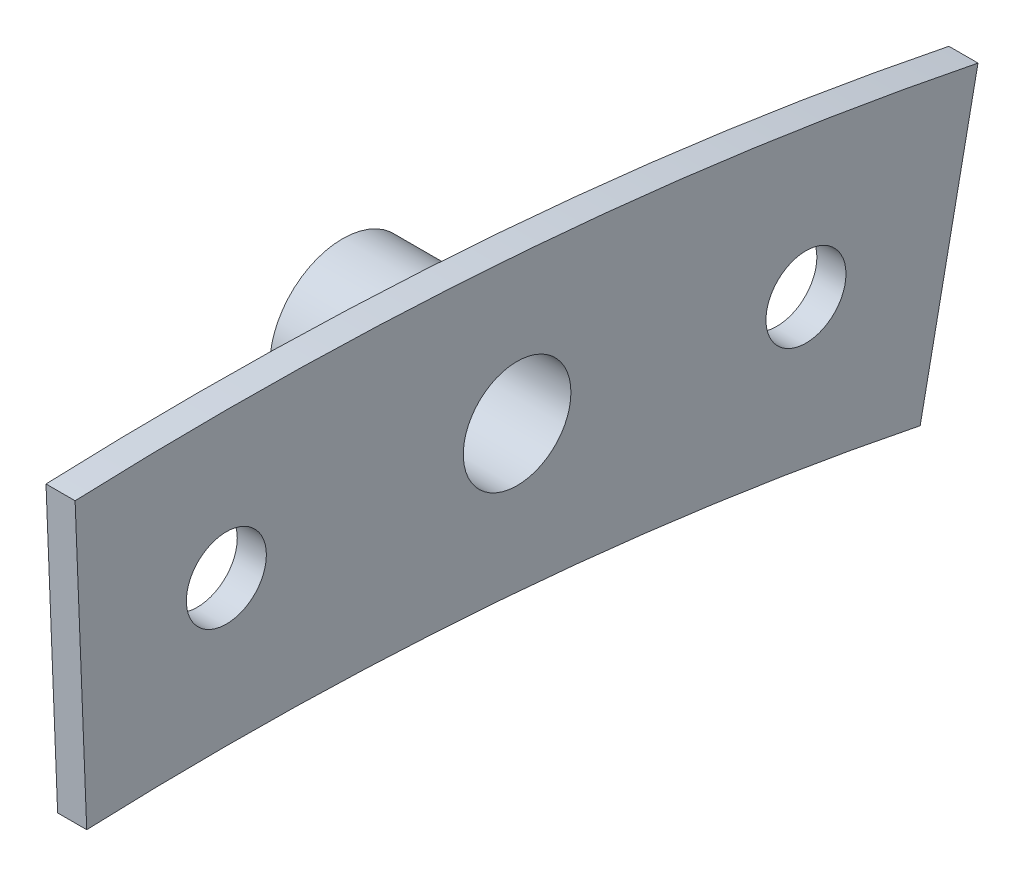
ISO-10303-21;
HEADER;
FILE_DESCRIPTION(('STEP AP214'),'2;1');
FILE_NAME('part.step','',(''),(''),'','','');
FILE_SCHEMA(('AUTOMOTIVE_DESIGN { 1 0 10303 214 1 1 1 1 }'));
ENDSEC;
DATA;
#1=APPLICATION_CONTEXT('core data for automotive mechanical design processes');
#2=APPLICATION_PROTOCOL_DEFINITION('international standard','automotive_design',2000,#1);
#3=PRODUCT_CONTEXT('',#1,'mechanical');
#4=PRODUCT('Part','Part','',(#3));
#5=PRODUCT_RELATED_PRODUCT_CATEGORY('part','',(#4));
#6=PRODUCT_DEFINITION_FORMATION('','',#4);
#7=PRODUCT_DEFINITION_CONTEXT('part definition',#1,'design');
#8=PRODUCT_DEFINITION('design','',#6,#7);
#9=PRODUCT_DEFINITION_SHAPE('','',#8);
#10=(LENGTH_UNIT() NAMED_UNIT(*) SI_UNIT(.MILLI.,.METRE.));
#11=(NAMED_UNIT(*) PLANE_ANGLE_UNIT() SI_UNIT($,.RADIAN.));
#12=(NAMED_UNIT(*) SI_UNIT($,.STERADIAN.) SOLID_ANGLE_UNIT());
#13=UNCERTAINTY_MEASURE_WITH_UNIT(LENGTH_MEASURE(1.E-05),#10,'distance_accuracy_value','');
#14=(GEOMETRIC_REPRESENTATION_CONTEXT(3) GLOBAL_UNCERTAINTY_ASSIGNED_CONTEXT((#13)) GLOBAL_UNIT_ASSIGNED_CONTEXT((#10,
#11,#12)) REPRESENTATION_CONTEXT('',''));
#15=CARTESIAN_POINT('',(0.,0.,0.));
#16=DIRECTION('',(0.,0.,1.));
#17=DIRECTION('',(1.,0.,0.));
#18=AXIS2_PLACEMENT_3D('',#15,#16,#17);
#19=CARTESIAN_POINT('',(2.54,0.,0.));
#20=DIRECTION('',(-1.,0.,0.));
#21=DIRECTION('',(0.,0.,1.));
#22=AXIS2_PLACEMENT_3D('',#19,#20,#21);
#23=CYLINDRICAL_SURFACE('',#22,330.2);
#24=CARTESIAN_POINT('',(0.,0.,0.));
#25=DIRECTION('',(1.,0.,0.));
#26=DIRECTION('',(0.,0.,-1.));
#27=AXIS2_PLACEMENT_3D('',#24,#25,#26);
#28=CIRCLE('',#27,330.2);
#29=CARTESIAN_POINT('',(0.,329.93584,13.2053581357871));
#30=VERTEX_POINT('',#29);
#31=CARTESIAN_POINT('',(0.,323.61500772706,-65.6152937493609));
#32=VERTEX_POINT('',#31);
#33=EDGE_CURVE('E127',#30,#32,#28,.F.);
#34=ORIENTED_EDGE('',*,*,#33,.F.);
#35=DIRECTION('',(-1.,0.,0.));
#36=VECTOR('',#35,1.);
#37=CARTESIAN_POINT('',(2.54,329.93584,13.2053581357871));
#38=LINE('',#37,#36);
#39=CARTESIAN_POINT('',(2.54,329.93584,13.2053581357871));
#40=VERTEX_POINT('',#39);
#41=EDGE_CURVE('E51',#40,#30,#38,.T.);
#42=ORIENTED_EDGE('',*,*,#41,.F.);
#43=CARTESIAN_POINT('',(2.54,0.,0.));
#44=DIRECTION('',(1.,0.,0.));
#45=DIRECTION('',(0.,0.,-1.));
#46=AXIS2_PLACEMENT_3D('',#43,#44,#45);
#47=CIRCLE('',#46,330.2);
#48=CARTESIAN_POINT('',(2.54,323.61500772706,-65.6152937493609));
#49=VERTEX_POINT('',#48);
#50=EDGE_CURVE('E109',#40,#49,#47,.F.);
#51=ORIENTED_EDGE('',*,*,#50,.T.);
#52=DIRECTION('',(-1.,0.,0.));
#53=VECTOR('',#52,1.);
#54=CARTESIAN_POINT('',(2.54,323.61500772706,-65.6152937493609));
#55=LINE('',#54,#53);
#56=EDGE_CURVE('E83',#49,#32,#55,.T.);
#57=ORIENTED_EDGE('',*,*,#56,.T.);
#58=EDGE_LOOP('',(#34,#42,#51,#57));
#59=FACE_BOUND('',#58,.T.);
#60=ADVANCED_FACE('F41',(#59),#23,.T.);
#61=CARTESIAN_POINT('',(2.54,0.,0.));
#62=DIRECTION('',(0.,-0.0399919991998399,0.9992));
#63=DIRECTION('',(0.,-0.9992,-0.0399919991998399));
#64=AXIS2_PLACEMENT_3D('',#61,#62,#63);
#65=PLANE('',#64);
#66=DIRECTION('',(0.,0.9992,0.0399919991998399));
#67=VECTOR('',#66,1.);
#68=CARTESIAN_POINT('',(0.,0.,0.));
#69=LINE('',#68,#67);
#70=CARTESIAN_POINT('',(0.,304.55616,12.1895613561112));
#71=VERTEX_POINT('',#70);
#72=EDGE_CURVE('E96',#71,#30,#69,.T.);
#73=ORIENTED_EDGE('',*,*,#72,.F.);
#74=DIRECTION('',(-1.,0.,0.));
#75=VECTOR('',#74,1.);
#76=CARTESIAN_POINT('',(2.54,304.55616,12.1895613561112));
#77=LINE('',#76,#75);
#78=CARTESIAN_POINT('',(2.54,304.55616,12.1895613561112));
#79=VERTEX_POINT('',#78);
#80=EDGE_CURVE('E90',#79,#71,#77,.T.);
#81=ORIENTED_EDGE('',*,*,#80,.F.);
#82=DIRECTION('',(0.,0.9992,0.0399919991998399));
#83=VECTOR('',#82,1.);
#84=CARTESIAN_POINT('',(2.54,0.,0.));
#85=LINE('',#84,#83);
#86=EDGE_CURVE('E94',#79,#40,#85,.T.);
#87=ORIENTED_EDGE('',*,*,#86,.T.);
#88=ORIENTED_EDGE('',*,*,#41,.T.);
#89=EDGE_LOOP('',(#73,#81,#87,#88));
#90=FACE_BOUND('',#89,.T.);
#91=ADVANCED_FACE('F92',(#90),#65,.T.);
#92=CARTESIAN_POINT('',(2.54,0.,0.));
#93=DIRECTION('',(-1.,0.,0.));
#94=DIRECTION('',(0.,0.,1.));
#95=AXIS2_PLACEMENT_3D('',#92,#93,#94);
#96=CYLINDRICAL_SURFACE('',#95,304.8);
#97=CARTESIAN_POINT('',(0.,0.,0.));
#98=DIRECTION('',(1.,0.,0.));
#99=DIRECTION('',(0.,0.,-1.));
#100=AXIS2_PLACEMENT_3D('',#97,#98,#99);
#101=CIRCLE('',#100,304.8);
#102=CARTESIAN_POINT('',(0.,298.721545594209,-60.5679634609485));
#103=VERTEX_POINT('',#102);
#104=EDGE_CURVE('E133',#71,#103,#101,.F.);
#105=ORIENTED_EDGE('',*,*,#104,.T.);
#106=DIRECTION('',(-1.,0.,0.));
#107=VECTOR('',#106,1.);
#108=CARTESIAN_POINT('',(2.54,298.721545594209,-60.5679634609485));
#109=LINE('',#108,#107);
#110=CARTESIAN_POINT('',(2.54,298.721545594209,-60.5679634609485));
#111=VERTEX_POINT('',#110);
#112=EDGE_CURVE('E100',#111,#103,#109,.T.);
#113=ORIENTED_EDGE('',*,*,#112,.F.);
#114=CARTESIAN_POINT('',(2.54,0.,0.));
#115=DIRECTION('',(1.,0.,0.));
#116=DIRECTION('',(0.,0.,-1.));
#117=AXIS2_PLACEMENT_3D('',#114,#115,#116);
#118=CIRCLE('',#117,304.8);
#119=EDGE_CURVE('E103',#79,#111,#118,.F.);
#120=ORIENTED_EDGE('',*,*,#119,.F.);
#121=ORIENTED_EDGE('',*,*,#80,.T.);
#122=EDGE_LOOP('',(#105,#113,#120,#121));
#123=FACE_BOUND('',#122,.T.);
#124=ADVANCED_FACE('F104',(#123),#96,.F.);
#125=CARTESIAN_POINT('',(2.54,0.,0.));
#126=DIRECTION('',(0.,0.198713790882377,0.980057564285463));
#127=DIRECTION('',(0.,-0.980057564285463,0.198713790882377));
#128=AXIS2_PLACEMENT_3D('',#125,#126,#127);
#129=PLANE('',#128);
#130=DIRECTION('',(0.,0.980057564285463,-0.198713790882377));
#131=VECTOR('',#130,1.);
#132=CARTESIAN_POINT('',(0.,0.,0.));
#133=LINE('',#132,#131);
#134=EDGE_CURVE('E76',#103,#32,#133,.T.);
#135=ORIENTED_EDGE('',*,*,#134,.T.);
#136=ORIENTED_EDGE('',*,*,#56,.F.);
#137=DIRECTION('',(0.,0.980057564285463,-0.198713790882377));
#138=VECTOR('',#137,1.);
#139=CARTESIAN_POINT('',(2.54,0.,0.));
#140=LINE('',#139,#138);
#141=EDGE_CURVE('E59',#111,#49,#140,.T.);
#142=ORIENTED_EDGE('',*,*,#141,.F.);
#143=ORIENTED_EDGE('',*,*,#112,.T.);
#144=EDGE_LOOP('',(#135,#136,#142,#143));
#145=FACE_BOUND('',#144,.T.);
#146=ADVANCED_FACE('F176',(#145),#129,.F.);
#147=CARTESIAN_POINT('',(2.54,316.484,-25.379671865491));
#148=DIRECTION('',(-1.,0.,0.));
#149=DIRECTION('',(0.,0.,1.));
#150=AXIS2_PLACEMENT_3D('',#147,#148,#149);
#151=CYLINDRICAL_SURFACE('',#150,4.69900000000001);
#152=CARTESIAN_POINT('',(2.54,316.484,-25.379671865491));
#153=DIRECTION('',(1.,0.,0.));
#154=DIRECTION('',(0.,0.,-1.));
#155=AXIS2_PLACEMENT_3D('',#152,#153,#154);
#156=CIRCLE('',#155,4.69900000000001);
#157=CARTESIAN_POINT('',(2.54,316.484,-30.078671865491));
#158=VERTEX_POINT('',#157);
#159=EDGE_CURVE('E113',#158,#158,#156,.T.);
#160=ORIENTED_EDGE('',*,*,#159,.T.);
#161=EDGE_LOOP('',(#160));
#162=FACE_BOUND('',#161,.T.);
#163=CARTESIAN_POINT('',(-6.35,316.484,-25.379671865491));
#164=DIRECTION('',(1.,0.,0.));
#165=DIRECTION('',(0.,0.,-1.));
#166=AXIS2_PLACEMENT_3D('',#163,#164,#165);
#167=CIRCLE('',#166,4.69900000000001);
#168=CARTESIAN_POINT('',(-6.35,316.484,-30.078671865491));
#169=VERTEX_POINT('',#168);
#170=EDGE_CURVE('E187',#169,#169,#167,.T.);
#171=ORIENTED_EDGE('',*,*,#170,.F.);
#172=EDGE_LOOP('',(#171));
#173=FACE_BOUND('',#172,.T.);
#174=ADVANCED_FACE('F165',(#162,#173),#151,.F.);
#175=CARTESIAN_POINT('',(2.54,313.4425024,-50.5969138310429));
#176=DIRECTION('',(-1.,0.,0.));
#177=DIRECTION('',(0.,0.,1.));
#178=AXIS2_PLACEMENT_3D('',#175,#176,#177);
#179=CYLINDRICAL_SURFACE('',#178,3.49250000000001);
#180=CARTESIAN_POINT('',(2.54,313.4425024,-50.5969138310429));
#181=DIRECTION('',(1.,0.,0.));
#182=DIRECTION('',(0.,0.,-1.));
#183=AXIS2_PLACEMENT_3D('',#180,#181,#182);
#184=CIRCLE('',#183,3.49250000000001);
#185=CARTESIAN_POINT('',(2.54,313.4425024,-54.089413831043));
#186=VERTEX_POINT('',#185);
#187=EDGE_CURVE('E142',#186,#186,#184,.T.);
#188=ORIENTED_EDGE('',*,*,#187,.T.);
#189=EDGE_LOOP('',(#188));
#190=FACE_BOUND('',#189,.T.);
#191=CARTESIAN_POINT('',(0.,313.4425024,-50.5969138310429));
#192=DIRECTION('',(1.,0.,0.));
#193=DIRECTION('',(0.,0.,-1.));
#194=AXIS2_PLACEMENT_3D('',#191,#192,#193);
#195=CIRCLE('',#194,3.49250000000001);
#196=CARTESIAN_POINT('',(0.,313.4425024,-54.089413831043));
#197=VERTEX_POINT('',#196);
#198=EDGE_CURVE('E123',#197,#197,#195,.T.);
#199=ORIENTED_EDGE('',*,*,#198,.F.);
#200=EDGE_LOOP('',(#199));
#201=FACE_BOUND('',#200,.T.);
#202=ADVANCED_FACE('F43',(#190,#201),#179,.F.);
#203=CARTESIAN_POINT('',(2.54,317.5,0.));
#204=DIRECTION('',(-1.,0.,0.));
#205=DIRECTION('',(0.,0.,1.));
#206=AXIS2_PLACEMENT_3D('',#203,#204,#205);
#207=CYLINDRICAL_SURFACE('',#206,3.49250000000001);
#208=CARTESIAN_POINT('',(2.54,317.5,0.));
#209=DIRECTION('',(1.,0.,0.));
#210=DIRECTION('',(0.,0.,-1.));
#211=AXIS2_PLACEMENT_3D('',#208,#209,#210);
#212=CIRCLE('',#211,3.49250000000001);
#213=CARTESIAN_POINT('',(2.54,317.5,-3.49250000000001));
#214=VERTEX_POINT('',#213);
#215=EDGE_CURVE('E119',#214,#214,#212,.T.);
#216=ORIENTED_EDGE('',*,*,#215,.T.);
#217=EDGE_LOOP('',(#216));
#218=FACE_BOUND('',#217,.T.);
#219=CARTESIAN_POINT('',(0.,317.5,0.));
#220=DIRECTION('',(1.,0.,0.));
#221=DIRECTION('',(0.,0.,-1.));
#222=AXIS2_PLACEMENT_3D('',#219,#220,#221);
#223=CIRCLE('',#222,3.49250000000001);
#224=CARTESIAN_POINT('',(0.,317.5,-3.49250000000001));
#225=VERTEX_POINT('',#224);
#226=EDGE_CURVE('E138',#225,#225,#223,.T.);
#227=ORIENTED_EDGE('',*,*,#226,.F.);
#228=EDGE_LOOP('',(#227));
#229=FACE_BOUND('',#228,.T.);
#230=ADVANCED_FACE('F155',(#218,#229),#207,.F.);
#231=CARTESIAN_POINT('',(2.54,0.,0.));
#232=DIRECTION('',(1.,0.,0.));
#233=DIRECTION('',(0.,0.,-1.));
#234=AXIS2_PLACEMENT_3D('',#231,#232,#233);
#235=PLANE('',#234);
#236=ORIENTED_EDGE('',*,*,#187,.F.);
#237=EDGE_LOOP('',(#236));
#238=FACE_BOUND('',#237,.T.);
#239=ORIENTED_EDGE('',*,*,#159,.F.);
#240=EDGE_LOOP('',(#239));
#241=FACE_BOUND('',#240,.T.);
#242=ORIENTED_EDGE('',*,*,#50,.F.);
#243=ORIENTED_EDGE('',*,*,#86,.F.);
#244=ORIENTED_EDGE('',*,*,#119,.T.);
#245=ORIENTED_EDGE('',*,*,#141,.T.);
#246=EDGE_LOOP('',(#242,#243,#244,#245));
#247=FACE_BOUND('',#246,.T.);
#248=ORIENTED_EDGE('',*,*,#215,.F.);
#249=EDGE_LOOP('',(#248));
#250=FACE_BOUND('',#249,.T.);
#251=ADVANCED_FACE('F107',(#238,#241,#247,#250),#235,.T.);
#252=CARTESIAN_POINT('',(0.,0.,0.));
#253=DIRECTION('',(1.,0.,0.));
#254=DIRECTION('',(0.,0.,-1.));
#255=AXIS2_PLACEMENT_3D('',#252,#253,#254);
#256=PLANE('',#255);
#257=CARTESIAN_POINT('',(0.,316.484,-25.379671865491));
#258=DIRECTION('',(1.,0.,0.));
#259=DIRECTION('',(0.,0.,-1.));
#260=AXIS2_PLACEMENT_3D('',#257,#258,#259);
#261=CIRCLE('',#260,6.35);
#262=CARTESIAN_POINT('',(0.,316.484,-31.729671865491));
#263=VERTEX_POINT('',#262);
#264=EDGE_CURVE('E11',#263,#263,#261,.F.);
#265=ORIENTED_EDGE('',*,*,#264,.F.);
#266=EDGE_LOOP('',(#265));
#267=FACE_BOUND('',#266,.T.);
#268=ORIENTED_EDGE('',*,*,#198,.T.);
#269=EDGE_LOOP('',(#268));
#270=FACE_BOUND('',#269,.T.);
#271=ORIENTED_EDGE('',*,*,#33,.T.);
#272=ORIENTED_EDGE('',*,*,#134,.F.);
#273=ORIENTED_EDGE('',*,*,#104,.F.);
#274=ORIENTED_EDGE('',*,*,#72,.T.);
#275=EDGE_LOOP('',(#271,#272,#273,#274));
#276=FACE_BOUND('',#275,.T.);
#277=ORIENTED_EDGE('',*,*,#226,.T.);
#278=EDGE_LOOP('',(#277));
#279=FACE_BOUND('',#278,.T.);
#280=ADVANCED_FACE('F147',(#267,#270,#276,#279),#256,.F.);
#281=CARTESIAN_POINT('',(-12.7,316.484,-25.379671865491));
#282=DIRECTION('',(-1.,0.,0.));
#283=DIRECTION('',(0.,0.,1.));
#284=AXIS2_PLACEMENT_3D('',#281,#282,#283);
#285=PLANE('',#284);
#286=CARTESIAN_POINT('',(-12.7,316.484,-25.379671865491));
#287=DIRECTION('',(-1.,0.,0.));
#288=DIRECTION('',(0.,0.,1.));
#289=AXIS2_PLACEMENT_3D('',#286,#287,#288);
#290=CIRCLE('',#289,6.35);
#291=CARTESIAN_POINT('',(-12.7,316.484,-19.029671865491));
#292=VERTEX_POINT('',#291);
#293=EDGE_CURVE('E128',#292,#292,#290,.T.);
#294=ORIENTED_EDGE('',*,*,#293,.T.);
#295=EDGE_LOOP('',(#294));
#296=FACE_BOUND('',#295,.T.);
#297=ADVANCED_FACE('F150',(#296),#285,.T.);
#298=CARTESIAN_POINT('',(-12.7,316.484,-25.379671865491));
#299=DIRECTION('',(1.,0.,0.));
#300=DIRECTION('',(0.,0.,-1.));
#301=AXIS2_PLACEMENT_3D('',#298,#299,#300);
#302=CYLINDRICAL_SURFACE('',#301,6.35);
#303=ORIENTED_EDGE('',*,*,#293,.F.);
#304=EDGE_LOOP('',(#303));
#305=FACE_BOUND('',#304,.T.);
#306=ORIENTED_EDGE('',*,*,#264,.T.);
#307=EDGE_LOOP('',(#306));
#308=FACE_BOUND('',#307,.T.);
#309=ADVANCED_FACE('F206',(#305,#308),#302,.T.);
#310=CARTESIAN_POINT('',(-6.35,316.484,-25.379671865491));
#311=DIRECTION('',(1.,0.,0.));
#312=DIRECTION('',(0.,0.,-1.));
#313=AXIS2_PLACEMENT_3D('',#310,#311,#312);
#314=PLANE('',#313);
#315=ORIENTED_EDGE('',*,*,#170,.T.);
#316=EDGE_LOOP('',(#315));
#317=FACE_BOUND('',#316,.T.);
#318=ADVANCED_FACE('F209',(#317),#314,.T.);
#319=CLOSED_SHELL('',(#60,#91,#124,#146,#174,#202,#230,#251,#280,#297,#309,#318));
#320=MANIFOLD_SOLID_BREP('B2',#319);
#321=ADVANCED_BREP_SHAPE_REPRESENTATION('',(#18,#320),#14);
#322=SHAPE_DEFINITION_REPRESENTATION(#9,#321);
ENDSEC;
END-ISO-10303-21;
